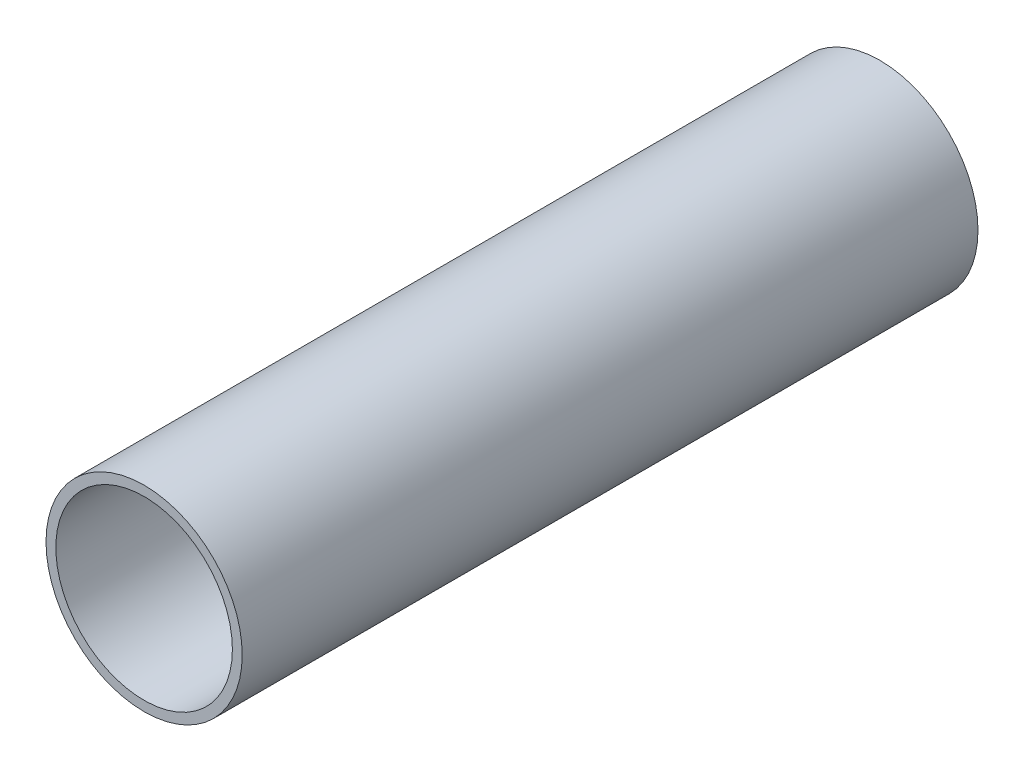
ISO-10303-21;
HEADER;
FILE_DESCRIPTION(('STEP AP214'),'2;1');
FILE_NAME('part.step','',(''),(''),'','','');
FILE_SCHEMA(('AUTOMOTIVE_DESIGN { 1 0 10303 214 1 1 1 1 }'));
ENDSEC;
DATA;
#1=APPLICATION_CONTEXT('core data for automotive mechanical design processes');
#2=APPLICATION_PROTOCOL_DEFINITION('international standard','automotive_design',2000,#1);
#3=PRODUCT_CONTEXT('',#1,'mechanical');
#4=PRODUCT('Part','Part','',(#3));
#5=PRODUCT_RELATED_PRODUCT_CATEGORY('part','',(#4));
#6=PRODUCT_DEFINITION_FORMATION('','',#4);
#7=PRODUCT_DEFINITION_CONTEXT('part definition',#1,'design');
#8=PRODUCT_DEFINITION('design','',#6,#7);
#9=PRODUCT_DEFINITION_SHAPE('','',#8);
#10=(LENGTH_UNIT() NAMED_UNIT(*) SI_UNIT(.MILLI.,.METRE.));
#11=(NAMED_UNIT(*) PLANE_ANGLE_UNIT() SI_UNIT($,.RADIAN.));
#12=(NAMED_UNIT(*) SI_UNIT($,.STERADIAN.) SOLID_ANGLE_UNIT());
#13=UNCERTAINTY_MEASURE_WITH_UNIT(LENGTH_MEASURE(1.E-05),#10,'distance_accuracy_value','');
#14=(GEOMETRIC_REPRESENTATION_CONTEXT(3) GLOBAL_UNCERTAINTY_ASSIGNED_CONTEXT((#13)) GLOBAL_UNIT_ASSIGNED_CONTEXT((#10,
#11,#12)) REPRESENTATION_CONTEXT('',''));
#15=CARTESIAN_POINT('',(0.,0.,0.));
#16=DIRECTION('',(0.,0.,1.));
#17=DIRECTION('',(1.,0.,0.));
#18=AXIS2_PLACEMENT_3D('',#15,#16,#17);
#19=CARTESIAN_POINT('',(0.,0.,150.));
#20=DIRECTION('',(0.,0.,1.));
#21=DIRECTION('',(1.,0.,0.));
#22=AXIS2_PLACEMENT_3D('',#19,#20,#21);
#23=PLANE('',#22);
#24=CARTESIAN_POINT('',(0.,0.,150.));
#25=DIRECTION('',(0.,0.,1.));
#26=DIRECTION('',(1.,0.,0.));
#27=AXIS2_PLACEMENT_3D('',#24,#25,#26);
#28=CIRCLE('',#27,20.);
#29=CARTESIAN_POINT('',(20.,0.,150.));
#30=VERTEX_POINT('',#29);
#31=EDGE_CURVE('E10',#30,#30,#28,.T.);
#32=ORIENTED_EDGE('',*,*,#31,.T.);
#33=EDGE_LOOP('',(#32));
#34=FACE_BOUND('',#33,.T.);
#35=CARTESIAN_POINT('',(0.,0.,150.));
#36=DIRECTION('',(0.,0.,1.));
#37=DIRECTION('',(1.,0.,0.));
#38=AXIS2_PLACEMENT_3D('',#35,#36,#37);
#39=CIRCLE('',#38,18.);
#40=CARTESIAN_POINT('',(18.,0.,150.));
#41=VERTEX_POINT('',#40);
#42=EDGE_CURVE('E50',#41,#41,#39,.T.);
#43=ORIENTED_EDGE('',*,*,#42,.F.);
#44=EDGE_LOOP('',(#43));
#45=FACE_BOUND('',#44,.T.);
#46=ADVANCED_FACE('F37',(#34,#45),#23,.T.);
#47=CARTESIAN_POINT('',(0.,0.,0.));
#48=DIRECTION('',(0.,0.,1.));
#49=DIRECTION('',(1.,0.,0.));
#50=AXIS2_PLACEMENT_3D('',#47,#48,#49);
#51=PLANE('',#50);
#52=CARTESIAN_POINT('',(0.,0.,0.));
#53=DIRECTION('',(0.,0.,1.));
#54=DIRECTION('',(1.,0.,0.));
#55=AXIS2_PLACEMENT_3D('',#52,#53,#54);
#56=CIRCLE('',#55,20.);
#57=CARTESIAN_POINT('',(20.,0.,0.));
#58=VERTEX_POINT('',#57);
#59=EDGE_CURVE('E41',#58,#58,#56,.T.);
#60=ORIENTED_EDGE('',*,*,#59,.F.);
#61=EDGE_LOOP('',(#60));
#62=FACE_BOUND('',#61,.T.);
#63=CARTESIAN_POINT('',(0.,0.,0.));
#64=DIRECTION('',(0.,0.,1.));
#65=DIRECTION('',(1.,0.,0.));
#66=AXIS2_PLACEMENT_3D('',#63,#64,#65);
#67=CIRCLE('',#66,18.);
#68=CARTESIAN_POINT('',(18.,0.,0.));
#69=VERTEX_POINT('',#68);
#70=EDGE_CURVE('E52',#69,#69,#67,.T.);
#71=ORIENTED_EDGE('',*,*,#70,.T.);
#72=EDGE_LOOP('',(#71));
#73=FACE_BOUND('',#72,.T.);
#74=ADVANCED_FACE('F64',(#62,#73),#51,.F.);
#75=CARTESIAN_POINT('',(0.,0.,150.));
#76=DIRECTION('',(0.,0.,-1.));
#77=DIRECTION('',(-1.,0.,0.));
#78=AXIS2_PLACEMENT_3D('',#75,#76,#77);
#79=CYLINDRICAL_SURFACE('',#78,20.);
#80=ORIENTED_EDGE('',*,*,#31,.F.);
#81=EDGE_LOOP('',(#80));
#82=FACE_BOUND('',#81,.T.);
#83=ORIENTED_EDGE('',*,*,#59,.T.);
#84=EDGE_LOOP('',(#83));
#85=FACE_BOUND('',#84,.T.);
#86=ADVANCED_FACE('F39',(#82,#85),#79,.T.);
#87=CARTESIAN_POINT('',(0.,0.,150.));
#88=DIRECTION('',(0.,0.,-1.));
#89=DIRECTION('',(-1.,0.,0.));
#90=AXIS2_PLACEMENT_3D('',#87,#88,#89);
#91=CYLINDRICAL_SURFACE('',#90,18.);
#92=ORIENTED_EDGE('',*,*,#42,.T.);
#93=EDGE_LOOP('',(#92));
#94=FACE_BOUND('',#93,.T.);
#95=ORIENTED_EDGE('',*,*,#70,.F.);
#96=EDGE_LOOP('',(#95));
#97=FACE_BOUND('',#96,.T.);
#98=ADVANCED_FACE('F60',(#94,#97),#91,.F.);
#99=CLOSED_SHELL('',(#46,#74,#86,#98));
#100=MANIFOLD_SOLID_BREP('B2',#99);
#101=ADVANCED_BREP_SHAPE_REPRESENTATION('',(#18,#100),#14);
#102=SHAPE_DEFINITION_REPRESENTATION(#9,#101);
ENDSEC;
END-ISO-10303-21;
